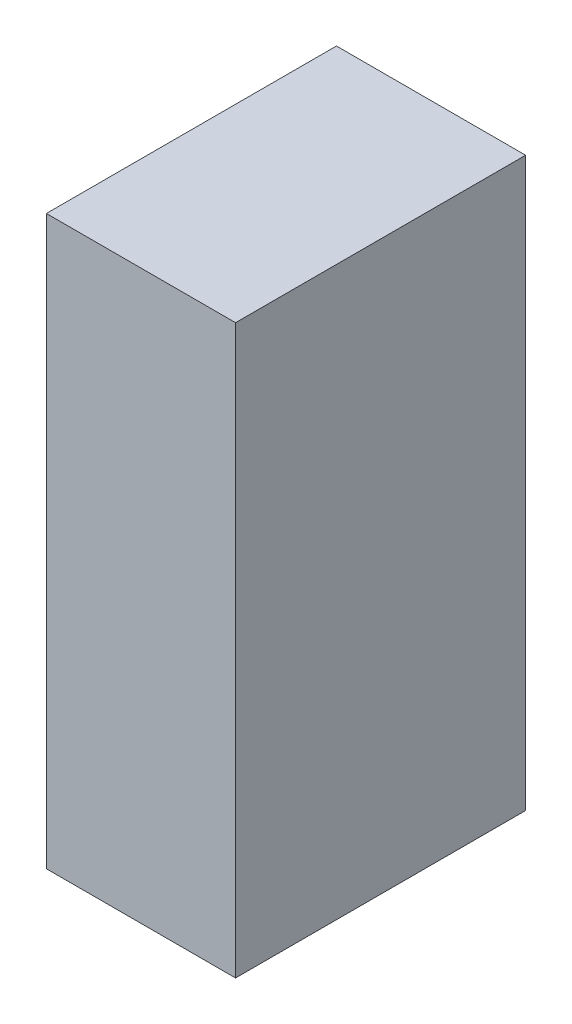
ISO-10303-21;
HEADER;
FILE_DESCRIPTION(('STEP AP214'),'2;1');
FILE_NAME('part.step','',(''),(''),'','','');
FILE_SCHEMA(('AUTOMOTIVE_DESIGN { 1 0 10303 214 1 1 1 1 }'));
ENDSEC;
DATA;
#1=APPLICATION_CONTEXT('core data for automotive mechanical design processes');
#2=APPLICATION_PROTOCOL_DEFINITION('international standard','automotive_design',2000,#1);
#3=PRODUCT_CONTEXT('',#1,'mechanical');
#4=PRODUCT('Part','Part','',(#3));
#5=PRODUCT_RELATED_PRODUCT_CATEGORY('part','',(#4));
#6=PRODUCT_DEFINITION_FORMATION('','',#4);
#7=PRODUCT_DEFINITION_CONTEXT('part definition',#1,'design');
#8=PRODUCT_DEFINITION('design','',#6,#7);
#9=PRODUCT_DEFINITION_SHAPE('','',#8);
#10=(LENGTH_UNIT() NAMED_UNIT(*) SI_UNIT(.MILLI.,.METRE.));
#11=(NAMED_UNIT(*) PLANE_ANGLE_UNIT() SI_UNIT($,.RADIAN.));
#12=(NAMED_UNIT(*) SI_UNIT($,.STERADIAN.) SOLID_ANGLE_UNIT());
#13=UNCERTAINTY_MEASURE_WITH_UNIT(LENGTH_MEASURE(1.E-05),#10,'distance_accuracy_value','');
#14=(GEOMETRIC_REPRESENTATION_CONTEXT(3) GLOBAL_UNCERTAINTY_ASSIGNED_CONTEXT((#13)) GLOBAL_UNIT_ASSIGNED_CONTEXT((#10,
#11,#12)) REPRESENTATION_CONTEXT('',''));
#15=CARTESIAN_POINT('',(0.,0.,0.));
#16=DIRECTION('',(0.,0.,1.));
#17=DIRECTION('',(1.,0.,0.));
#18=AXIS2_PLACEMENT_3D('',#15,#16,#17);
#19=CARTESIAN_POINT('',(-0.1499997,0.45000164,0.));
#20=DIRECTION('',(1.,0.,0.));
#21=DIRECTION('',(0.,0.,-1.));
#22=AXIS2_PLACEMENT_3D('',#19,#20,#21);
#23=PLANE('',#22);
#24=DIRECTION('',(0.,0.,1.));
#25=VECTOR('',#24,1.);
#26=CARTESIAN_POINT('',(-0.1499997,-0.45000164,0.));
#27=LINE('',#26,#25);
#28=CARTESIAN_POINT('',(-0.1499997,-0.45000164,0.));
#29=VERTEX_POINT('',#28);
#30=CARTESIAN_POINT('',(-0.1499997,-0.45000164,0.45999908));
#31=VERTEX_POINT('',#30);
#32=EDGE_CURVE('E19',#29,#31,#27,.T.);
#33=ORIENTED_EDGE('',*,*,#32,.T.);
#34=DIRECTION('',(0.,1.,0.));
#35=VECTOR('',#34,1.);
#36=CARTESIAN_POINT('',(-0.1499997,-0.45000164,0.45999908));
#37=LINE('',#36,#35);
#38=CARTESIAN_POINT('',(-0.1499997,0.45000164,0.45999908));
#39=VERTEX_POINT('',#38);
#40=EDGE_CURVE('E54',#31,#39,#37,.T.);
#41=ORIENTED_EDGE('',*,*,#40,.T.);
#42=DIRECTION('',(0.,0.,-1.));
#43=VECTOR('',#42,1.);
#44=CARTESIAN_POINT('',(-0.1499997,0.45000164,0.));
#45=LINE('',#44,#43);
#46=CARTESIAN_POINT('',(-0.1499997,0.45000164,0.));
#47=VERTEX_POINT('',#46);
#48=EDGE_CURVE('E75',#39,#47,#45,.T.);
#49=ORIENTED_EDGE('',*,*,#48,.T.);
#50=DIRECTION('',(0.,1.,0.));
#51=VECTOR('',#50,1.);
#52=CARTESIAN_POINT('',(-0.1499997,-0.45000164,0.));
#53=LINE('',#52,#51);
#54=EDGE_CURVE('E57',#29,#47,#53,.T.);
#55=ORIENTED_EDGE('',*,*,#54,.F.);
#56=EDGE_LOOP('',(#33,#41,#49,#55));
#57=FACE_BOUND('',#56,.T.);
#58=ADVANCED_FACE('F16',(#57),#23,.F.);
#59=CARTESIAN_POINT('',(-0.1499997,-0.45000164,0.));
#60=DIRECTION('',(0.,1.,0.));
#61=DIRECTION('',(0.,0.,1.));
#62=AXIS2_PLACEMENT_3D('',#59,#60,#61);
#63=PLANE('',#62);
#64=DIRECTION('',(0.,0.,1.));
#65=VECTOR('',#64,1.);
#66=CARTESIAN_POINT('',(0.15000224,-0.45000164,0.));
#67=LINE('',#66,#65);
#68=CARTESIAN_POINT('',(0.15000224,-0.45000164,0.));
#69=VERTEX_POINT('',#68);
#70=CARTESIAN_POINT('',(0.15000224,-0.45000164,0.45999908));
#71=VERTEX_POINT('',#70);
#72=EDGE_CURVE('E72',#69,#71,#67,.T.);
#73=ORIENTED_EDGE('',*,*,#72,.T.);
#74=DIRECTION('',(-1.,0.,0.));
#75=VECTOR('',#74,1.);
#76=CARTESIAN_POINT('',(0.15000224,-0.45000164,0.45999908));
#77=LINE('',#76,#75);
#78=EDGE_CURVE('E62',#71,#31,#77,.T.);
#79=ORIENTED_EDGE('',*,*,#78,.T.);
#80=ORIENTED_EDGE('',*,*,#32,.F.);
#81=DIRECTION('',(-1.,0.,0.));
#82=VECTOR('',#81,1.);
#83=CARTESIAN_POINT('',(0.15000224,-0.45000164,0.));
#84=LINE('',#83,#82);
#85=EDGE_CURVE('E77',#69,#29,#84,.T.);
#86=ORIENTED_EDGE('',*,*,#85,.F.);
#87=EDGE_LOOP('',(#73,#79,#80,#86));
#88=FACE_BOUND('',#87,.T.);
#89=ADVANCED_FACE('F71',(#88),#63,.F.);
#90=CARTESIAN_POINT('',(0.15000224,-0.45000164,0.45999908));
#91=DIRECTION('',(0.,0.,-1.));
#92=DIRECTION('',(-1.,0.,0.));
#93=AXIS2_PLACEMENT_3D('',#90,#91,#92);
#94=PLANE('',#93);
#95=DIRECTION('',(1.,0.,0.));
#96=VECTOR('',#95,1.);
#97=CARTESIAN_POINT('',(0.15000224,0.45000164,0.45999908));
#98=LINE('',#97,#96);
#99=CARTESIAN_POINT('',(0.15000224,0.45000164,0.45999908));
#100=VERTEX_POINT('',#99);
#101=EDGE_CURVE('E68',#100,#39,#98,.F.);
#102=ORIENTED_EDGE('',*,*,#101,.T.);
#103=ORIENTED_EDGE('',*,*,#40,.F.);
#104=ORIENTED_EDGE('',*,*,#78,.F.);
#105=DIRECTION('',(0.,1.,0.));
#106=VECTOR('',#105,1.);
#107=CARTESIAN_POINT('',(0.15000224,-0.45000164,0.45999908));
#108=LINE('',#107,#106);
#109=EDGE_CURVE('E82',#71,#100,#108,.T.);
#110=ORIENTED_EDGE('',*,*,#109,.T.);
#111=EDGE_LOOP('',(#102,#103,#104,#110));
#112=FACE_BOUND('',#111,.T.);
#113=ADVANCED_FACE('F65',(#112),#94,.F.);
#114=CARTESIAN_POINT('',(0.15000224,0.45000164,0.));
#115=DIRECTION('',(0.,-1.,0.));
#116=DIRECTION('',(0.,0.,-1.));
#117=AXIS2_PLACEMENT_3D('',#114,#115,#116);
#118=PLANE('',#117);
#119=ORIENTED_EDGE('',*,*,#48,.F.);
#120=ORIENTED_EDGE('',*,*,#101,.F.);
#121=DIRECTION('',(0.,0.,1.));
#122=VECTOR('',#121,1.);
#123=CARTESIAN_POINT('',(0.15000224,0.45000164,0.));
#124=LINE('',#123,#122);
#125=CARTESIAN_POINT('',(0.15000224,0.45000164,0.));
#126=VERTEX_POINT('',#125);
#127=EDGE_CURVE('E25',#100,#126,#124,.F.);
#128=ORIENTED_EDGE('',*,*,#127,.T.);
#129=DIRECTION('',(-1.,0.,0.));
#130=VECTOR('',#129,1.);
#131=CARTESIAN_POINT('',(0.15000224,0.45000164,0.));
#132=LINE('',#131,#130);
#133=EDGE_CURVE('E33',#47,#126,#132,.F.);
#134=ORIENTED_EDGE('',*,*,#133,.F.);
#135=EDGE_LOOP('',(#119,#120,#128,#134));
#136=FACE_BOUND('',#135,.T.);
#137=ADVANCED_FACE('F87',(#136),#118,.F.);
#138=CARTESIAN_POINT('',(0.15000224,-0.45000164,0.));
#139=DIRECTION('',(0.,0.,-1.));
#140=DIRECTION('',(-1.,0.,0.));
#141=AXIS2_PLACEMENT_3D('',#138,#139,#140);
#142=PLANE('',#141);
#143=ORIENTED_EDGE('',*,*,#133,.T.);
#144=DIRECTION('',(0.,1.,0.));
#145=VECTOR('',#144,1.);
#146=CARTESIAN_POINT('',(0.15000224,-0.45000164,0.));
#147=LINE('',#146,#145);
#148=EDGE_CURVE('E11',#126,#69,#147,.F.);
#149=ORIENTED_EDGE('',*,*,#148,.T.);
#150=ORIENTED_EDGE('',*,*,#85,.T.);
#151=ORIENTED_EDGE('',*,*,#54,.T.);
#152=EDGE_LOOP('',(#143,#149,#150,#151));
#153=FACE_BOUND('',#152,.T.);
#154=ADVANCED_FACE('F90',(#153),#142,.T.);
#155=CARTESIAN_POINT('',(0.15000224,-0.45000164,0.));
#156=DIRECTION('',(-1.,0.,0.));
#157=DIRECTION('',(0.,0.,1.));
#158=AXIS2_PLACEMENT_3D('',#155,#156,#157);
#159=PLANE('',#158);
#160=ORIENTED_EDGE('',*,*,#127,.F.);
#161=ORIENTED_EDGE('',*,*,#109,.F.);
#162=ORIENTED_EDGE('',*,*,#72,.F.);
#163=ORIENTED_EDGE('',*,*,#148,.F.);
#164=EDGE_LOOP('',(#160,#161,#162,#163));
#165=FACE_BOUND('',#164,.T.);
#166=ADVANCED_FACE('F89',(#165),#159,.F.);
#167=CLOSED_SHELL('',(#58,#89,#113,#137,#154,#166));
#168=MANIFOLD_SOLID_BREP('B1',#167);
#169=ADVANCED_BREP_SHAPE_REPRESENTATION('',(#18,#168),#14);
#170=SHAPE_DEFINITION_REPRESENTATION(#9,#169);
ENDSEC;
END-ISO-10303-21;
